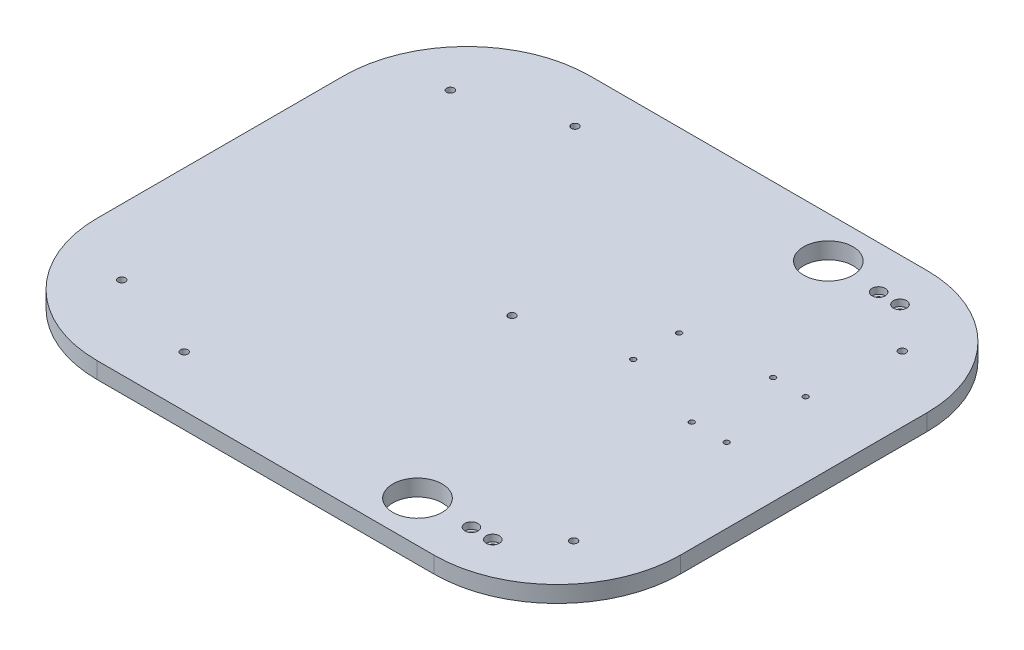
ISO-10303-21;
HEADER;
FILE_DESCRIPTION(('STEP AP214'),'2;1');
FILE_NAME('part.step','',(''),(''),'','','');
FILE_SCHEMA(('AUTOMOTIVE_DESIGN { 1 0 10303 214 1 1 1 1 }'));
ENDSEC;
DATA;
#1=APPLICATION_CONTEXT('core data for automotive mechanical design processes');
#2=APPLICATION_PROTOCOL_DEFINITION('international standard','automotive_design',2000,#1);
#3=PRODUCT_CONTEXT('',#1,'mechanical');
#4=PRODUCT('Part','Part','',(#3));
#5=PRODUCT_RELATED_PRODUCT_CATEGORY('part','',(#4));
#6=PRODUCT_DEFINITION_FORMATION('','',#4);
#7=PRODUCT_DEFINITION_CONTEXT('part definition',#1,'design');
#8=PRODUCT_DEFINITION('design','',#6,#7);
#9=PRODUCT_DEFINITION_SHAPE('','',#8);
#10=(LENGTH_UNIT() NAMED_UNIT(*) SI_UNIT(.MILLI.,.METRE.));
#11=(NAMED_UNIT(*) PLANE_ANGLE_UNIT() SI_UNIT($,.RADIAN.));
#12=(NAMED_UNIT(*) SI_UNIT($,.STERADIAN.) SOLID_ANGLE_UNIT());
#13=UNCERTAINTY_MEASURE_WITH_UNIT(LENGTH_MEASURE(1.E-05),#10,'distance_accuracy_value','');
#14=(GEOMETRIC_REPRESENTATION_CONTEXT(3) GLOBAL_UNCERTAINTY_ASSIGNED_CONTEXT((#13)) GLOBAL_UNIT_ASSIGNED_CONTEXT((#10,
#11,#12)) REPRESENTATION_CONTEXT('',''));
#15=CARTESIAN_POINT('',(0.,0.,0.));
#16=DIRECTION('',(0.,0.,1.));
#17=DIRECTION('',(1.,0.,0.));
#18=AXIS2_PLACEMENT_3D('',#15,#16,#17);
#19=CARTESIAN_POINT('',(0.,10.,0.));
#20=DIRECTION('',(0.,1.,0.));
#21=DIRECTION('',(0.,0.,1.));
#22=AXIS2_PLACEMENT_3D('',#19,#20,#21);
#23=PLANE('',#22);
#24=CARTESIAN_POINT('',(-80.5544997387853,10.,118.9));
#25=DIRECTION('',(0.,1.,0.));
#26=DIRECTION('',(0.,0.,1.));
#27=AXIS2_PLACEMENT_3D('',#24,#25,#26);
#28=CIRCLE('',#27,2.25);
#29=CARTESIAN_POINT('',(-80.5544997387853,10.,121.15));
#30=VERTEX_POINT('',#29);
#31=EDGE_CURVE('E308',#30,#30,#28,.T.);
#32=ORIENTED_EDGE('',*,*,#31,.F.);
#33=EDGE_LOOP('',(#32));
#34=FACE_BOUND('',#33,.T.);
#35=CARTESIAN_POINT('',(-80.5544997387854,10.,-118.9));
#36=DIRECTION('',(0.,1.,0.));
#37=DIRECTION('',(0.,0.,1.));
#38=AXIS2_PLACEMENT_3D('',#35,#36,#37);
#39=CIRCLE('',#38,2.25);
#40=CARTESIAN_POINT('',(-80.5544997387854,10.,-116.65));
#41=VERTEX_POINT('',#40);
#42=EDGE_CURVE('E302',#41,#41,#39,.T.);
#43=ORIENTED_EDGE('',*,*,#42,.F.);
#44=EDGE_LOOP('',(#43));
#45=FACE_BOUND('',#44,.T.);
#46=CARTESIAN_POINT('',(0.,10.,0.));
#47=DIRECTION('',(0.,1.,0.));
#48=DIRECTION('',(0.,0.,1.));
#49=AXIS2_PLACEMENT_3D('',#46,#47,#48);
#50=CIRCLE('',#49,2.25);
#51=CARTESIAN_POINT('',(0.,10.,2.25));
#52=VERTEX_POINT('',#51);
#53=EDGE_CURVE('E296',#52,#52,#50,.T.);
#54=ORIENTED_EDGE('',*,*,#53,.F.);
#55=EDGE_LOOP('',(#54));
#56=FACE_BOUND('',#55,.T.);
#57=CARTESIAN_POINT('',(137.5,10.,100.));
#58=DIRECTION('',(0.,1.,0.));
#59=DIRECTION('',(0.,0.,1.));
#60=AXIS2_PLACEMENT_3D('',#57,#58,#59);
#61=CIRCLE('',#60,2.25);
#62=CARTESIAN_POINT('',(137.5,10.,102.25));
#63=VERTEX_POINT('',#62);
#64=EDGE_CURVE('E290',#63,#63,#61,.T.);
#65=ORIENTED_EDGE('',*,*,#64,.F.);
#66=EDGE_LOOP('',(#65));
#67=FACE_BOUND('',#66,.T.);
#68=CARTESIAN_POINT('',(-137.5,10.,-100.));
#69=DIRECTION('',(0.,1.,0.));
#70=DIRECTION('',(0.,0.,1.));
#71=AXIS2_PLACEMENT_3D('',#68,#69,#70);
#72=CIRCLE('',#71,2.25);
#73=CARTESIAN_POINT('',(-137.5,10.,-97.75));
#74=VERTEX_POINT('',#73);
#75=EDGE_CURVE('E284',#74,#74,#72,.T.);
#76=ORIENTED_EDGE('',*,*,#75,.F.);
#77=EDGE_LOOP('',(#76));
#78=FACE_BOUND('',#77,.T.);
#79=CARTESIAN_POINT('',(-137.5,10.,100.));
#80=DIRECTION('',(0.,1.,0.));
#81=DIRECTION('',(0.,0.,1.));
#82=AXIS2_PLACEMENT_3D('',#79,#80,#81);
#83=CIRCLE('',#82,2.25);
#84=CARTESIAN_POINT('',(-137.5,10.,102.25));
#85=VERTEX_POINT('',#84);
#86=EDGE_CURVE('E278',#85,#85,#83,.T.);
#87=ORIENTED_EDGE('',*,*,#86,.F.);
#88=EDGE_LOOP('',(#87));
#89=FACE_BOUND('',#88,.T.);
#90=CARTESIAN_POINT('',(137.5,10.,-100.));
#91=DIRECTION('',(0.,1.,0.));
#92=DIRECTION('',(0.,0.,1.));
#93=AXIS2_PLACEMENT_3D('',#90,#91,#92);
#94=CIRCLE('',#93,2.25);
#95=CARTESIAN_POINT('',(137.5,10.,-97.75));
#96=VERTEX_POINT('',#95);
#97=EDGE_CURVE('E272',#96,#96,#94,.T.);
#98=ORIENTED_EDGE('',*,*,#97,.F.);
#99=EDGE_LOOP('',(#98));
#100=FACE_BOUND('',#99,.T.);
#101=CARTESIAN_POINT('',(132.110460527628,10.,-46.5350027392989));
#102=DIRECTION('',(0.,1.,0.));
#103=DIRECTION('',(0.,0.,1.));
#104=AXIS2_PLACEMENT_3D('',#101,#102,#103);
#105=CIRCLE('',#104,1.59999999999999);
#106=CARTESIAN_POINT('',(132.110460527628,10.,-44.9350027392989));
#107=VERTEX_POINT('',#106);
#108=EDGE_CURVE('E266',#107,#107,#105,.T.);
#109=ORIENTED_EDGE('',*,*,#108,.F.);
#110=EDGE_LOOP('',(#109));
#111=FACE_BOUND('',#110,.T.);
#112=CARTESIAN_POINT('',(112.111563058018,10.,-46.7450027392988));
#113=DIRECTION('',(0.,1.,0.));
#114=DIRECTION('',(0.,0.,1.));
#115=AXIS2_PLACEMENT_3D('',#112,#113,#114);
#116=CIRCLE('',#115,1.6);
#117=CARTESIAN_POINT('',(112.111563058018,10.,-45.1450027392988));
#118=VERTEX_POINT('',#117);
#119=EDGE_CURVE('E260',#118,#118,#116,.T.);
#120=ORIENTED_EDGE('',*,*,#119,.F.);
#121=EDGE_LOOP('',(#120));
#122=FACE_BOUND('',#121,.T.);
#123=CARTESIAN_POINT('',(110.841563058018,10.,1.51499726070117));
#124=DIRECTION('',(0.,1.,0.));
#125=DIRECTION('',(0.,0.,1.));
#126=AXIS2_PLACEMENT_3D('',#123,#124,#125);
#127=CIRCLE('',#126,1.6);
#128=CARTESIAN_POINT('',(110.841563058018,10.,3.11499726070118));
#129=VERTEX_POINT('',#128);
#130=EDGE_CURVE('E254',#129,#129,#127,.T.);
#131=ORIENTED_EDGE('',*,*,#130,.F.);
#132=EDGE_LOOP('',(#131));
#133=FACE_BOUND('',#132,.T.);
#134=CARTESIAN_POINT('',(132.110460527628,10.,1.51499726070117));
#135=DIRECTION('',(0.,1.,0.));
#136=DIRECTION('',(0.,0.,1.));
#137=AXIS2_PLACEMENT_3D('',#134,#135,#136);
#138=CIRCLE('',#137,1.59999999999999);
#139=CARTESIAN_POINT('',(132.110460527628,10.,3.11499726070116));
#140=VERTEX_POINT('',#139);
#141=EDGE_CURVE('E248',#140,#140,#138,.T.);
#142=ORIENTED_EDGE('',*,*,#141,.F.);
#143=EDGE_LOOP('',(#142));
#144=FACE_BOUND('',#143,.T.);
#145=CARTESIAN_POINT('',(60.0415630580176,10.,-13.7250027392988));
#146=DIRECTION('',(0.,1.,0.));
#147=DIRECTION('',(0.,0.,1.));
#148=AXIS2_PLACEMENT_3D('',#145,#146,#147);
#149=CIRCLE('',#148,1.6);
#150=CARTESIAN_POINT('',(60.0415630580176,10.,-12.1250027392988));
#151=VERTEX_POINT('',#150);
#152=EDGE_CURVE('E242',#151,#151,#149,.T.);
#153=ORIENTED_EDGE('',*,*,#152,.F.);
#154=EDGE_LOOP('',(#153));
#155=FACE_BOUND('',#154,.T.);
#156=CARTESIAN_POINT('',(60.0415630580176,10.,-41.6650027392988));
#157=DIRECTION('',(0.,1.,0.));
#158=DIRECTION('',(0.,0.,1.));
#159=AXIS2_PLACEMENT_3D('',#156,#157,#158);
#160=CIRCLE('',#159,1.6);
#161=CARTESIAN_POINT('',(60.0415630580176,10.,-40.0650027392988));
#162=VERTEX_POINT('',#161);
#163=EDGE_CURVE('E236',#162,#162,#160,.T.);
#164=ORIENTED_EDGE('',*,*,#163,.F.);
#165=EDGE_LOOP('',(#164));
#166=FACE_BOUND('',#165,.T.);
#167=CARTESIAN_POINT('',(99.1999999999999,10.,-123.9));
#168=DIRECTION('',(0.,1.,0.));
#169=DIRECTION('',(0.,0.,1.));
#170=AXIS2_PLACEMENT_3D('',#167,#168,#169);
#171=CIRCLE('',#170,3.99999999999999);
#172=CARTESIAN_POINT('',(99.1999999999999,10.,-119.9));
#173=VERTEX_POINT('',#172);
#174=EDGE_CURVE('E230',#173,#173,#171,.T.);
#175=ORIENTED_EDGE('',*,*,#174,.F.);
#176=EDGE_LOOP('',(#175));
#177=FACE_BOUND('',#176,.T.);
#178=CARTESIAN_POINT('',(112.2,10.,-123.9));
#179=DIRECTION('',(0.,1.,0.));
#180=DIRECTION('',(0.,0.,1.));
#181=AXIS2_PLACEMENT_3D('',#178,#179,#180);
#182=CIRCLE('',#181,3.99999999999999);
#183=CARTESIAN_POINT('',(112.2,10.,-119.9));
#184=VERTEX_POINT('',#183);
#185=EDGE_CURVE('E218',#184,#184,#182,.T.);
#186=ORIENTED_EDGE('',*,*,#185,.F.);
#187=EDGE_LOOP('',(#186));
#188=FACE_BOUND('',#187,.T.);
#189=CARTESIAN_POINT('',(112.2,10.,123.9));
#190=DIRECTION('',(0.,1.,0.));
#191=DIRECTION('',(0.,0.,1.));
#192=AXIS2_PLACEMENT_3D('',#189,#190,#191);
#193=CIRCLE('',#192,3.99999999999999);
#194=CARTESIAN_POINT('',(112.2,10.,127.9));
#195=VERTEX_POINT('',#194);
#196=EDGE_CURVE('E206',#195,#195,#193,.T.);
#197=ORIENTED_EDGE('',*,*,#196,.F.);
#198=EDGE_LOOP('',(#197));
#199=FACE_BOUND('',#198,.T.);
#200=CARTESIAN_POINT('',(99.1999999999999,10.,123.9));
#201=DIRECTION('',(0.,1.,0.));
#202=DIRECTION('',(0.,0.,1.));
#203=AXIS2_PLACEMENT_3D('',#200,#201,#202);
#204=CIRCLE('',#203,3.99999999999999);
#205=CARTESIAN_POINT('',(99.1999999999999,10.,127.9));
#206=VERTEX_POINT('',#205);
#207=EDGE_CURVE('E194',#206,#206,#204,.T.);
#208=ORIENTED_EDGE('',*,*,#207,.F.);
#209=EDGE_LOOP('',(#208));
#210=FACE_BOUND('',#209,.T.);
#211=CARTESIAN_POINT('',(67.5,10.,125.));
#212=DIRECTION('',(0.,1.,0.));
#213=DIRECTION('',(0.,0.,1.));
#214=AXIS2_PLACEMENT_3D('',#211,#212,#213);
#215=CIRCLE('',#214,15.);
#216=CARTESIAN_POINT('',(67.5,10.,140.));
#217=VERTEX_POINT('',#216);
#218=EDGE_CURVE('E166',#217,#217,#215,.T.);
#219=ORIENTED_EDGE('',*,*,#218,.F.);
#220=EDGE_LOOP('',(#219));
#221=FACE_BOUND('',#220,.T.);
#222=DIRECTION('',(1.,0.,0.));
#223=VECTOR('',#222,1.);
#224=CARTESIAN_POINT('',(-177.5,10.,150.));
#225=LINE('',#224,#223);
#226=CARTESIAN_POINT('',(-102.5,10.,150.));
#227=VERTEX_POINT('',#226);
#228=CARTESIAN_POINT('',(102.5,10.,150.));
#229=VERTEX_POINT('',#228);
#230=EDGE_CURVE('E170',#227,#229,#225,.T.);
#231=ORIENTED_EDGE('',*,*,#230,.T.);
#232=CARTESIAN_POINT('',(102.5,10.,75.));
#233=DIRECTION('',(0.,1.,0.));
#234=DIRECTION('',(0.,0.,1.));
#235=AXIS2_PLACEMENT_3D('',#232,#233,#234);
#236=CIRCLE('',#235,75.);
#237=CARTESIAN_POINT('',(177.5,10.,75.));
#238=VERTEX_POINT('',#237);
#239=EDGE_CURVE('E153',#229,#238,#236,.T.);
#240=ORIENTED_EDGE('',*,*,#239,.T.);
#241=DIRECTION('',(0.,0.,-1.));
#242=VECTOR('',#241,1.);
#243=CARTESIAN_POINT('',(177.5,10.,150.));
#244=LINE('',#243,#242);
#245=CARTESIAN_POINT('',(177.5,10.,-75.));
#246=VERTEX_POINT('',#245);
#247=EDGE_CURVE('E124',#238,#246,#244,.T.);
#248=ORIENTED_EDGE('',*,*,#247,.T.);
#249=CARTESIAN_POINT('',(102.5,10.,-75.));
#250=DIRECTION('',(0.,1.,0.));
#251=DIRECTION('',(0.,0.,1.));
#252=AXIS2_PLACEMENT_3D('',#249,#250,#251);
#253=CIRCLE('',#252,75.);
#254=CARTESIAN_POINT('',(102.5,10.,-150.));
#255=VERTEX_POINT('',#254);
#256=EDGE_CURVE('E151',#246,#255,#253,.T.);
#257=ORIENTED_EDGE('',*,*,#256,.T.);
#258=DIRECTION('',(-1.,0.,0.));
#259=VECTOR('',#258,1.);
#260=CARTESIAN_POINT('',(177.5,10.,-150.));
#261=LINE('',#260,#259);
#262=CARTESIAN_POINT('',(-102.5,10.,-150.));
#263=VERTEX_POINT('',#262);
#264=EDGE_CURVE('E131',#255,#263,#261,.T.);
#265=ORIENTED_EDGE('',*,*,#264,.T.);
#266=CARTESIAN_POINT('',(-102.5,10.,-75.));
#267=DIRECTION('',(0.,1.,0.));
#268=DIRECTION('',(0.,0.,1.));
#269=AXIS2_PLACEMENT_3D('',#266,#267,#268);
#270=CIRCLE('',#269,75.);
#271=CARTESIAN_POINT('',(-177.5,10.,-75.));
#272=VERTEX_POINT('',#271);
#273=EDGE_CURVE('E59',#263,#272,#270,.T.);
#274=ORIENTED_EDGE('',*,*,#273,.T.);
#275=DIRECTION('',(0.,0.,1.));
#276=VECTOR('',#275,1.);
#277=CARTESIAN_POINT('',(-177.5,10.,-150.));
#278=LINE('',#277,#276);
#279=CARTESIAN_POINT('',(-177.5,10.,75.));
#280=VERTEX_POINT('',#279);
#281=EDGE_CURVE('E134',#272,#280,#278,.T.);
#282=ORIENTED_EDGE('',*,*,#281,.T.);
#283=CARTESIAN_POINT('',(-102.5,10.,75.));
#284=DIRECTION('',(0.,1.,0.));
#285=DIRECTION('',(0.,0.,1.));
#286=AXIS2_PLACEMENT_3D('',#283,#284,#285);
#287=CIRCLE('',#286,75.);
#288=EDGE_CURVE('E149',#280,#227,#287,.T.);
#289=ORIENTED_EDGE('',*,*,#288,.T.);
#290=EDGE_LOOP('',(#231,#240,#248,#257,#265,#274,#282,#289));
#291=FACE_BOUND('',#290,.T.);
#292=CARTESIAN_POINT('',(67.5,10.,-125.));
#293=DIRECTION('',(0.,1.,0.));
#294=DIRECTION('',(0.,0.,1.));
#295=AXIS2_PLACEMENT_3D('',#292,#293,#294);
#296=CIRCLE('',#295,15.);
#297=CARTESIAN_POINT('',(67.5,10.,-110.));
#298=VERTEX_POINT('',#297);
#299=EDGE_CURVE('E177',#298,#298,#296,.T.);
#300=ORIENTED_EDGE('',*,*,#299,.F.);
#301=EDGE_LOOP('',(#300));
#302=FACE_BOUND('',#301,.T.);
#303=ADVANCED_FACE('F39',(#34,#45,#56,#67,#78,#89,#100,#111,#122,#133,#144,#155,#166,#177,#188,
#199,#210,#221,#291,#302),#23,.T.);
#304=CARTESIAN_POINT('',(0.,0.,0.));
#305=DIRECTION('',(0.,1.,0.));
#306=DIRECTION('',(0.,0.,1.));
#307=AXIS2_PLACEMENT_3D('',#304,#305,#306);
#308=PLANE('',#307);
#309=CARTESIAN_POINT('',(-80.5544997387853,0.,118.9));
#310=DIRECTION('',(0.,1.,0.));
#311=DIRECTION('',(0.,0.,1.));
#312=AXIS2_PLACEMENT_3D('',#309,#310,#311);
#313=CIRCLE('',#312,2.25);
#314=CARTESIAN_POINT('',(-80.5544997387853,0.,121.15));
#315=VERTEX_POINT('',#314);
#316=EDGE_CURVE('E305',#315,#315,#313,.T.);
#317=ORIENTED_EDGE('',*,*,#316,.T.);
#318=EDGE_LOOP('',(#317));
#319=FACE_BOUND('',#318,.T.);
#320=CARTESIAN_POINT('',(-80.5544997387854,0.,-118.9));
#321=DIRECTION('',(0.,1.,0.));
#322=DIRECTION('',(0.,0.,1.));
#323=AXIS2_PLACEMENT_3D('',#320,#321,#322);
#324=CIRCLE('',#323,2.25);
#325=CARTESIAN_POINT('',(-80.5544997387854,0.,-116.65));
#326=VERTEX_POINT('',#325);
#327=EDGE_CURVE('E299',#326,#326,#324,.T.);
#328=ORIENTED_EDGE('',*,*,#327,.T.);
#329=EDGE_LOOP('',(#328));
#330=FACE_BOUND('',#329,.T.);
#331=CARTESIAN_POINT('',(0.,0.,0.));
#332=DIRECTION('',(0.,1.,0.));
#333=DIRECTION('',(0.,0.,1.));
#334=AXIS2_PLACEMENT_3D('',#331,#332,#333);
#335=CIRCLE('',#334,2.25);
#336=CARTESIAN_POINT('',(0.,0.,2.25));
#337=VERTEX_POINT('',#336);
#338=EDGE_CURVE('E293',#337,#337,#335,.T.);
#339=ORIENTED_EDGE('',*,*,#338,.T.);
#340=EDGE_LOOP('',(#339));
#341=FACE_BOUND('',#340,.T.);
#342=CARTESIAN_POINT('',(137.5,0.,100.));
#343=DIRECTION('',(0.,1.,0.));
#344=DIRECTION('',(0.,0.,1.));
#345=AXIS2_PLACEMENT_3D('',#342,#343,#344);
#346=CIRCLE('',#345,2.25);
#347=CARTESIAN_POINT('',(137.5,0.,102.25));
#348=VERTEX_POINT('',#347);
#349=EDGE_CURVE('E287',#348,#348,#346,.T.);
#350=ORIENTED_EDGE('',*,*,#349,.T.);
#351=EDGE_LOOP('',(#350));
#352=FACE_BOUND('',#351,.T.);
#353=CARTESIAN_POINT('',(-137.5,0.,-100.));
#354=DIRECTION('',(0.,1.,0.));
#355=DIRECTION('',(0.,0.,1.));
#356=AXIS2_PLACEMENT_3D('',#353,#354,#355);
#357=CIRCLE('',#356,2.25);
#358=CARTESIAN_POINT('',(-137.5,0.,-97.75));
#359=VERTEX_POINT('',#358);
#360=EDGE_CURVE('E281',#359,#359,#357,.T.);
#361=ORIENTED_EDGE('',*,*,#360,.T.);
#362=EDGE_LOOP('',(#361));
#363=FACE_BOUND('',#362,.T.);
#364=CARTESIAN_POINT('',(-137.5,0.,100.));
#365=DIRECTION('',(0.,1.,0.));
#366=DIRECTION('',(0.,0.,1.));
#367=AXIS2_PLACEMENT_3D('',#364,#365,#366);
#368=CIRCLE('',#367,2.25);
#369=CARTESIAN_POINT('',(-137.5,0.,102.25));
#370=VERTEX_POINT('',#369);
#371=EDGE_CURVE('E275',#370,#370,#368,.T.);
#372=ORIENTED_EDGE('',*,*,#371,.T.);
#373=EDGE_LOOP('',(#372));
#374=FACE_BOUND('',#373,.T.);
#375=CARTESIAN_POINT('',(137.5,0.,-100.));
#376=DIRECTION('',(0.,1.,0.));
#377=DIRECTION('',(0.,0.,1.));
#378=AXIS2_PLACEMENT_3D('',#375,#376,#377);
#379=CIRCLE('',#378,2.25);
#380=CARTESIAN_POINT('',(137.5,0.,-97.75));
#381=VERTEX_POINT('',#380);
#382=EDGE_CURVE('E269',#381,#381,#379,.T.);
#383=ORIENTED_EDGE('',*,*,#382,.T.);
#384=EDGE_LOOP('',(#383));
#385=FACE_BOUND('',#384,.T.);
#386=CARTESIAN_POINT('',(132.110460527628,0.,-46.5350027392989));
#387=DIRECTION('',(0.,1.,0.));
#388=DIRECTION('',(0.,0.,1.));
#389=AXIS2_PLACEMENT_3D('',#386,#387,#388);
#390=CIRCLE('',#389,1.59999999999999);
#391=CARTESIAN_POINT('',(132.110460527628,0.,-44.9350027392989));
#392=VERTEX_POINT('',#391);
#393=EDGE_CURVE('E263',#392,#392,#390,.T.);
#394=ORIENTED_EDGE('',*,*,#393,.T.);
#395=EDGE_LOOP('',(#394));
#396=FACE_BOUND('',#395,.T.);
#397=CARTESIAN_POINT('',(112.111563058018,0.,-46.7450027392988));
#398=DIRECTION('',(0.,1.,0.));
#399=DIRECTION('',(0.,0.,1.));
#400=AXIS2_PLACEMENT_3D('',#397,#398,#399);
#401=CIRCLE('',#400,1.6);
#402=CARTESIAN_POINT('',(112.111563058018,0.,-45.1450027392988));
#403=VERTEX_POINT('',#402);
#404=EDGE_CURVE('E257',#403,#403,#401,.T.);
#405=ORIENTED_EDGE('',*,*,#404,.T.);
#406=EDGE_LOOP('',(#405));
#407=FACE_BOUND('',#406,.T.);
#408=CARTESIAN_POINT('',(110.841563058018,0.,1.51499726070117));
#409=DIRECTION('',(0.,1.,0.));
#410=DIRECTION('',(0.,0.,1.));
#411=AXIS2_PLACEMENT_3D('',#408,#409,#410);
#412=CIRCLE('',#411,1.6);
#413=CARTESIAN_POINT('',(110.841563058018,0.,3.11499726070118));
#414=VERTEX_POINT('',#413);
#415=EDGE_CURVE('E251',#414,#414,#412,.T.);
#416=ORIENTED_EDGE('',*,*,#415,.T.);
#417=EDGE_LOOP('',(#416));
#418=FACE_BOUND('',#417,.T.);
#419=CARTESIAN_POINT('',(132.110460527628,0.,1.51499726070117));
#420=DIRECTION('',(0.,1.,0.));
#421=DIRECTION('',(0.,0.,1.));
#422=AXIS2_PLACEMENT_3D('',#419,#420,#421);
#423=CIRCLE('',#422,1.59999999999999);
#424=CARTESIAN_POINT('',(132.110460527628,0.,3.11499726070116));
#425=VERTEX_POINT('',#424);
#426=EDGE_CURVE('E245',#425,#425,#423,.T.);
#427=ORIENTED_EDGE('',*,*,#426,.T.);
#428=EDGE_LOOP('',(#427));
#429=FACE_BOUND('',#428,.T.);
#430=CARTESIAN_POINT('',(60.0415630580176,0.,-13.7250027392988));
#431=DIRECTION('',(0.,1.,0.));
#432=DIRECTION('',(0.,0.,1.));
#433=AXIS2_PLACEMENT_3D('',#430,#431,#432);
#434=CIRCLE('',#433,1.6);
#435=CARTESIAN_POINT('',(60.0415630580176,0.,-12.1250027392988));
#436=VERTEX_POINT('',#435);
#437=EDGE_CURVE('E239',#436,#436,#434,.T.);
#438=ORIENTED_EDGE('',*,*,#437,.T.);
#439=EDGE_LOOP('',(#438));
#440=FACE_BOUND('',#439,.T.);
#441=CARTESIAN_POINT('',(60.0415630580176,0.,-41.6650027392988));
#442=DIRECTION('',(0.,1.,0.));
#443=DIRECTION('',(0.,0.,1.));
#444=AXIS2_PLACEMENT_3D('',#441,#442,#443);
#445=CIRCLE('',#444,1.6);
#446=CARTESIAN_POINT('',(60.0415630580176,0.,-40.0650027392988));
#447=VERTEX_POINT('',#446);
#448=EDGE_CURVE('E233',#447,#447,#445,.T.);
#449=ORIENTED_EDGE('',*,*,#448,.T.);
#450=EDGE_LOOP('',(#449));
#451=FACE_BOUND('',#450,.T.);
#452=CARTESIAN_POINT('',(99.1999999999999,0.,-123.9));
#453=DIRECTION('',(0.,1.,0.));
#454=DIRECTION('',(0.,0.,1.));
#455=AXIS2_PLACEMENT_3D('',#452,#453,#454);
#456=CIRCLE('',#455,2.25000000000002);
#457=CARTESIAN_POINT('',(99.1999999999999,0.,-121.65));
#458=VERTEX_POINT('',#457);
#459=EDGE_CURVE('E221',#458,#458,#456,.T.);
#460=ORIENTED_EDGE('',*,*,#459,.T.);
#461=EDGE_LOOP('',(#460));
#462=FACE_BOUND('',#461,.T.);
#463=CARTESIAN_POINT('',(112.2,0.,-123.9));
#464=DIRECTION('',(0.,1.,0.));
#465=DIRECTION('',(0.,0.,1.));
#466=AXIS2_PLACEMENT_3D('',#463,#464,#465);
#467=CIRCLE('',#466,2.25000000000002);
#468=CARTESIAN_POINT('',(112.2,0.,-121.65));
#469=VERTEX_POINT('',#468);
#470=EDGE_CURVE('E209',#469,#469,#467,.T.);
#471=ORIENTED_EDGE('',*,*,#470,.T.);
#472=EDGE_LOOP('',(#471));
#473=FACE_BOUND('',#472,.T.);
#474=CARTESIAN_POINT('',(112.2,0.,123.9));
#475=DIRECTION('',(0.,1.,0.));
#476=DIRECTION('',(0.,0.,1.));
#477=AXIS2_PLACEMENT_3D('',#474,#475,#476);
#478=CIRCLE('',#477,2.25000000000002);
#479=CARTESIAN_POINT('',(112.2,0.,126.15));
#480=VERTEX_POINT('',#479);
#481=EDGE_CURVE('E197',#480,#480,#478,.T.);
#482=ORIENTED_EDGE('',*,*,#481,.T.);
#483=EDGE_LOOP('',(#482));
#484=FACE_BOUND('',#483,.T.);
#485=CARTESIAN_POINT('',(99.1999999999999,0.,123.9));
#486=DIRECTION('',(0.,1.,0.));
#487=DIRECTION('',(0.,0.,1.));
#488=AXIS2_PLACEMENT_3D('',#485,#486,#487);
#489=CIRCLE('',#488,2.25000000000002);
#490=CARTESIAN_POINT('',(99.1999999999999,0.,126.15));
#491=VERTEX_POINT('',#490);
#492=EDGE_CURVE('E183',#491,#491,#489,.T.);
#493=ORIENTED_EDGE('',*,*,#492,.T.);
#494=EDGE_LOOP('',(#493));
#495=FACE_BOUND('',#494,.T.);
#496=DIRECTION('',(0.,0.,-1.));
#497=VECTOR('',#496,1.);
#498=CARTESIAN_POINT('',(177.5,0.,150.));
#499=LINE('',#498,#497);
#500=CARTESIAN_POINT('',(177.5,0.,75.));
#501=VERTEX_POINT('',#500);
#502=CARTESIAN_POINT('',(177.5,0.,-75.));
#503=VERTEX_POINT('',#502);
#504=EDGE_CURVE('E121',#501,#503,#499,.T.);
#505=ORIENTED_EDGE('',*,*,#504,.F.);
#506=CARTESIAN_POINT('',(102.5,0.,75.));
#507=DIRECTION('',(0.,1.,0.));
#508=DIRECTION('',(0.,0.,1.));
#509=AXIS2_PLACEMENT_3D('',#506,#507,#508);
#510=CIRCLE('',#509,75.);
#511=CARTESIAN_POINT('',(102.5,0.,150.));
#512=VERTEX_POINT('',#511);
#513=EDGE_CURVE('E104',#501,#512,#510,.F.);
#514=ORIENTED_EDGE('',*,*,#513,.T.);
#515=DIRECTION('',(1.,0.,0.));
#516=VECTOR('',#515,1.);
#517=CARTESIAN_POINT('',(-177.5,0.,150.));
#518=LINE('',#517,#516);
#519=CARTESIAN_POINT('',(-102.5,0.,150.));
#520=VERTEX_POINT('',#519);
#521=EDGE_CURVE('E132',#520,#512,#518,.T.);
#522=ORIENTED_EDGE('',*,*,#521,.F.);
#523=CARTESIAN_POINT('',(-102.5,0.,75.));
#524=DIRECTION('',(0.,1.,0.));
#525=DIRECTION('',(0.,0.,1.));
#526=AXIS2_PLACEMENT_3D('',#523,#524,#525);
#527=CIRCLE('',#526,75.);
#528=CARTESIAN_POINT('',(-177.5,0.,75.));
#529=VERTEX_POINT('',#528);
#530=EDGE_CURVE('E142',#520,#529,#527,.F.);
#531=ORIENTED_EDGE('',*,*,#530,.T.);
#532=DIRECTION('',(0.,0.,1.));
#533=VECTOR('',#532,1.);
#534=CARTESIAN_POINT('',(-177.5,0.,-150.));
#535=LINE('',#534,#533);
#536=CARTESIAN_POINT('',(-177.5,0.,-75.));
#537=VERTEX_POINT('',#536);
#538=EDGE_CURVE('E136',#537,#529,#535,.T.);
#539=ORIENTED_EDGE('',*,*,#538,.F.);
#540=CARTESIAN_POINT('',(-102.5,0.,-75.));
#541=DIRECTION('',(0.,1.,0.));
#542=DIRECTION('',(0.,0.,1.));
#543=AXIS2_PLACEMENT_3D('',#540,#541,#542);
#544=CIRCLE('',#543,75.);
#545=CARTESIAN_POINT('',(-102.5,0.,-150.));
#546=VERTEX_POINT('',#545);
#547=EDGE_CURVE('E125',#537,#546,#544,.F.);
#548=ORIENTED_EDGE('',*,*,#547,.T.);
#549=DIRECTION('',(-1.,0.,0.));
#550=VECTOR('',#549,1.);
#551=CARTESIAN_POINT('',(177.5,0.,-150.));
#552=LINE('',#551,#550);
#553=CARTESIAN_POINT('',(102.5,0.,-150.));
#554=VERTEX_POINT('',#553);
#555=EDGE_CURVE('E165',#554,#546,#552,.T.);
#556=ORIENTED_EDGE('',*,*,#555,.F.);
#557=CARTESIAN_POINT('',(102.5,0.,-75.));
#558=DIRECTION('',(0.,1.,0.));
#559=DIRECTION('',(0.,0.,1.));
#560=AXIS2_PLACEMENT_3D('',#557,#558,#559);
#561=CIRCLE('',#560,75.);
#562=EDGE_CURVE('E115',#554,#503,#561,.F.);
#563=ORIENTED_EDGE('',*,*,#562,.T.);
#564=EDGE_LOOP('',(#505,#514,#522,#531,#539,#548,#556,#563));
#565=FACE_BOUND('',#564,.T.);
#566=CARTESIAN_POINT('',(67.5,0.,125.));
#567=DIRECTION('',(0.,1.,0.));
#568=DIRECTION('',(0.,0.,1.));
#569=AXIS2_PLACEMENT_3D('',#566,#567,#568);
#570=CIRCLE('',#569,15.);
#571=CARTESIAN_POINT('',(67.5,0.,140.));
#572=VERTEX_POINT('',#571);
#573=EDGE_CURVE('E174',#572,#572,#570,.T.);
#574=ORIENTED_EDGE('',*,*,#573,.T.);
#575=EDGE_LOOP('',(#574));
#576=FACE_BOUND('',#575,.T.);
#577=CARTESIAN_POINT('',(67.5,0.,-125.));
#578=DIRECTION('',(0.,1.,0.));
#579=DIRECTION('',(0.,0.,1.));
#580=AXIS2_PLACEMENT_3D('',#577,#578,#579);
#581=CIRCLE('',#580,15.);
#582=CARTESIAN_POINT('',(67.5,0.,-110.));
#583=VERTEX_POINT('',#582);
#584=EDGE_CURVE('E180',#583,#583,#581,.T.);
#585=ORIENTED_EDGE('',*,*,#584,.T.);
#586=EDGE_LOOP('',(#585));
#587=FACE_BOUND('',#586,.T.);
#588=ADVANCED_FACE('F128',(#319,#330,#341,#352,#363,#374,#385,#396,#407,#418,#429,#440,#451,
#462,#473,#484,#495,#565,#576,#587),#308,.F.);
#589=CARTESIAN_POINT('',(177.5,10.,-150.));
#590=DIRECTION('',(0.,0.,1.));
#591=DIRECTION('',(1.,0.,0.));
#592=AXIS2_PLACEMENT_3D('',#589,#590,#591);
#593=PLANE('',#592);
#594=ORIENTED_EDGE('',*,*,#264,.F.);
#595=DIRECTION('',(0.,-1.,0.));
#596=VECTOR('',#595,1.);
#597=CARTESIAN_POINT('',(102.5,10.,-150.));
#598=LINE('',#597,#596);
#599=EDGE_CURVE('E157',#255,#554,#598,.T.);
#600=ORIENTED_EDGE('',*,*,#599,.T.);
#601=ORIENTED_EDGE('',*,*,#555,.T.);
#602=DIRECTION('',(0.,-1.,0.));
#603=VECTOR('',#602,1.);
#604=CARTESIAN_POINT('',(-102.5,10.,-150.));
#605=LINE('',#604,#603);
#606=EDGE_CURVE('E155',#546,#263,#605,.F.);
#607=ORIENTED_EDGE('',*,*,#606,.T.);
#608=EDGE_LOOP('',(#594,#600,#601,#607));
#609=FACE_BOUND('',#608,.T.);
#610=ADVANCED_FACE('F363',(#609),#593,.F.);
#611=CARTESIAN_POINT('',(-177.5,10.,-150.));
#612=DIRECTION('',(1.,0.,0.));
#613=DIRECTION('',(0.,0.,-1.));
#614=AXIS2_PLACEMENT_3D('',#611,#612,#613);
#615=PLANE('',#614);
#616=ORIENTED_EDGE('',*,*,#538,.T.);
#617=DIRECTION('',(0.,-1.,0.));
#618=VECTOR('',#617,1.);
#619=CARTESIAN_POINT('',(-177.5,10.,75.));
#620=LINE('',#619,#618);
#621=EDGE_CURVE('E11',#529,#280,#620,.F.);
#622=ORIENTED_EDGE('',*,*,#621,.T.);
#623=ORIENTED_EDGE('',*,*,#281,.F.);
#624=DIRECTION('',(0.,-1.,0.));
#625=VECTOR('',#624,1.);
#626=CARTESIAN_POINT('',(-177.5,10.,-75.));
#627=LINE('',#626,#625);
#628=EDGE_CURVE('E47',#272,#537,#627,.T.);
#629=ORIENTED_EDGE('',*,*,#628,.T.);
#630=EDGE_LOOP('',(#616,#622,#623,#629));
#631=FACE_BOUND('',#630,.T.);
#632=ADVANCED_FACE('F162',(#631),#615,.F.);
#633=CARTESIAN_POINT('',(-177.5,10.,150.));
#634=DIRECTION('',(0.,0.,-1.));
#635=DIRECTION('',(-1.,0.,0.));
#636=AXIS2_PLACEMENT_3D('',#633,#634,#635);
#637=PLANE('',#636);
#638=ORIENTED_EDGE('',*,*,#521,.T.);
#639=DIRECTION('',(0.,-1.,0.));
#640=VECTOR('',#639,1.);
#641=CARTESIAN_POINT('',(102.5,10.,150.));
#642=LINE('',#641,#640);
#643=EDGE_CURVE('E109',#512,#229,#642,.F.);
#644=ORIENTED_EDGE('',*,*,#643,.T.);
#645=ORIENTED_EDGE('',*,*,#230,.F.);
#646=DIRECTION('',(0.,-1.,0.));
#647=VECTOR('',#646,1.);
#648=CARTESIAN_POINT('',(-102.5,10.,150.));
#649=LINE('',#648,#647);
#650=EDGE_CURVE('E114',#227,#520,#649,.T.);
#651=ORIENTED_EDGE('',*,*,#650,.T.);
#652=EDGE_LOOP('',(#638,#644,#645,#651));
#653=FACE_BOUND('',#652,.T.);
#654=ADVANCED_FACE('F376',(#653),#637,.F.);
#655=CARTESIAN_POINT('',(177.5,10.,150.));
#656=DIRECTION('',(-1.,0.,0.));
#657=DIRECTION('',(0.,0.,1.));
#658=AXIS2_PLACEMENT_3D('',#655,#656,#657);
#659=PLANE('',#658);
#660=ORIENTED_EDGE('',*,*,#247,.F.);
#661=DIRECTION('',(0.,-1.,0.));
#662=VECTOR('',#661,1.);
#663=CARTESIAN_POINT('',(177.5,10.,75.));
#664=LINE('',#663,#662);
#665=EDGE_CURVE('E108',#238,#501,#664,.T.);
#666=ORIENTED_EDGE('',*,*,#665,.T.);
#667=ORIENTED_EDGE('',*,*,#504,.T.);
#668=DIRECTION('',(0.,-1.,0.));
#669=VECTOR('',#668,1.);
#670=CARTESIAN_POINT('',(177.5,10.,-75.));
#671=LINE('',#670,#669);
#672=EDGE_CURVE('E126',#503,#246,#671,.F.);
#673=ORIENTED_EDGE('',*,*,#672,.T.);
#674=EDGE_LOOP('',(#660,#666,#667,#673));
#675=FACE_BOUND('',#674,.T.);
#676=ADVANCED_FACE('F120',(#675),#659,.F.);
#677=CARTESIAN_POINT('',(67.5,10.,125.));
#678=DIRECTION('',(0.,-1.,0.));
#679=DIRECTION('',(0.,0.,-1.));
#680=AXIS2_PLACEMENT_3D('',#677,#678,#679);
#681=CYLINDRICAL_SURFACE('',#680,15.);
#682=ORIENTED_EDGE('',*,*,#218,.T.);
#683=EDGE_LOOP('',(#682));
#684=FACE_BOUND('',#683,.T.);
#685=ORIENTED_EDGE('',*,*,#573,.F.);
#686=EDGE_LOOP('',(#685));
#687=FACE_BOUND('',#686,.T.);
#688=ADVANCED_FACE('F358',(#684,#687),#681,.F.);
#689=CARTESIAN_POINT('',(67.5,10.,-125.));
#690=DIRECTION('',(0.,-1.,0.));
#691=DIRECTION('',(0.,0.,-1.));
#692=AXIS2_PLACEMENT_3D('',#689,#690,#691);
#693=CYLINDRICAL_SURFACE('',#692,15.);
#694=ORIENTED_EDGE('',*,*,#299,.T.);
#695=EDGE_LOOP('',(#694));
#696=FACE_BOUND('',#695,.T.);
#697=ORIENTED_EDGE('',*,*,#584,.F.);
#698=EDGE_LOOP('',(#697));
#699=FACE_BOUND('',#698,.T.);
#700=ADVANCED_FACE('F354',(#696,#699),#693,.F.);
#701=CARTESIAN_POINT('',(99.1999999999999,10.,123.9));
#702=DIRECTION('',(0.,1.,0.));
#703=DIRECTION('',(0.,0.,1.));
#704=AXIS2_PLACEMENT_3D('',#701,#702,#703);
#705=CYLINDRICAL_SURFACE('',#704,2.25000000000001);
#706=ORIENTED_EDGE('',*,*,#492,.F.);
#707=EDGE_LOOP('',(#706));
#708=FACE_BOUND('',#707,.T.);
#709=CARTESIAN_POINT('',(99.1999999999999,6.,123.9));
#710=DIRECTION('',(0.,1.,0.));
#711=DIRECTION('',(0.,0.,1.));
#712=AXIS2_PLACEMENT_3D('',#709,#710,#711);
#713=CIRCLE('',#712,2.25);
#714=CARTESIAN_POINT('',(99.1999999999999,6.,126.15));
#715=VERTEX_POINT('',#714);
#716=EDGE_CURVE('E188',#715,#715,#713,.T.);
#717=ORIENTED_EDGE('',*,*,#716,.T.);
#718=EDGE_LOOP('',(#717));
#719=FACE_BOUND('',#718,.T.);
#720=ADVANCED_FACE('F357',(#708,#719),#705,.F.);
#721=CARTESIAN_POINT('',(101.45,6.,123.9));
#722=DIRECTION('',(0.,-1.,0.));
#723=DIRECTION('',(0.,0.,-1.));
#724=AXIS2_PLACEMENT_3D('',#721,#722,#723);
#725=PLANE('',#724);
#726=ORIENTED_EDGE('',*,*,#716,.F.);
#727=EDGE_LOOP('',(#726));
#728=FACE_BOUND('',#727,.T.);
#729=CARTESIAN_POINT('',(99.1999999999999,6.,123.9));
#730=DIRECTION('',(0.,1.,0.));
#731=DIRECTION('',(0.,0.,1.));
#732=AXIS2_PLACEMENT_3D('',#729,#730,#731);
#733=CIRCLE('',#732,4.);
#734=CARTESIAN_POINT('',(99.1999999999999,6.,127.9));
#735=VERTEX_POINT('',#734);
#736=EDGE_CURVE('E191',#735,#735,#733,.T.);
#737=ORIENTED_EDGE('',*,*,#736,.T.);
#738=EDGE_LOOP('',(#737));
#739=FACE_BOUND('',#738,.T.);
#740=ADVANCED_FACE('F647',(#728,#739),#725,.F.);
#741=CARTESIAN_POINT('',(99.1999999999999,10.,123.9));
#742=DIRECTION('',(0.,1.,0.));
#743=DIRECTION('',(0.,0.,1.));
#744=AXIS2_PLACEMENT_3D('',#741,#742,#743);
#745=CYLINDRICAL_SURFACE('',#744,4.);
#746=ORIENTED_EDGE('',*,*,#736,.F.);
#747=EDGE_LOOP('',(#746));
#748=FACE_BOUND('',#747,.T.);
#749=ORIENTED_EDGE('',*,*,#207,.T.);
#750=EDGE_LOOP('',(#749));
#751=FACE_BOUND('',#750,.T.);
#752=ADVANCED_FACE('F637',(#748,#751),#745,.F.);
#753=CARTESIAN_POINT('',(112.2,10.,123.9));
#754=DIRECTION('',(0.,1.,0.));
#755=DIRECTION('',(0.,0.,1.));
#756=AXIS2_PLACEMENT_3D('',#753,#754,#755);
#757=CYLINDRICAL_SURFACE('',#756,2.25000000000001);
#758=ORIENTED_EDGE('',*,*,#481,.F.);
#759=EDGE_LOOP('',(#758));
#760=FACE_BOUND('',#759,.T.);
#761=CARTESIAN_POINT('',(112.2,6.,123.9));
#762=DIRECTION('',(0.,1.,0.));
#763=DIRECTION('',(0.,0.,1.));
#764=AXIS2_PLACEMENT_3D('',#761,#762,#763);
#765=CIRCLE('',#764,2.25);
#766=CARTESIAN_POINT('',(112.2,6.,126.15));
#767=VERTEX_POINT('',#766);
#768=EDGE_CURVE('E200',#767,#767,#765,.T.);
#769=ORIENTED_EDGE('',*,*,#768,.T.);
#770=EDGE_LOOP('',(#769));
#771=FACE_BOUND('',#770,.T.);
#772=ADVANCED_FACE('F627',(#760,#771),#757,.F.);
#773=CARTESIAN_POINT('',(114.45,6.,123.9));
#774=DIRECTION('',(0.,-1.,0.));
#775=DIRECTION('',(0.,0.,-1.));
#776=AXIS2_PLACEMENT_3D('',#773,#774,#775);
#777=PLANE('',#776);
#778=ORIENTED_EDGE('',*,*,#768,.F.);
#779=EDGE_LOOP('',(#778));
#780=FACE_BOUND('',#779,.T.);
#781=CARTESIAN_POINT('',(112.2,6.,123.9));
#782=DIRECTION('',(0.,1.,0.));
#783=DIRECTION('',(0.,0.,1.));
#784=AXIS2_PLACEMENT_3D('',#781,#782,#783);
#785=CIRCLE('',#784,4.);
#786=CARTESIAN_POINT('',(112.2,6.,127.9));
#787=VERTEX_POINT('',#786);
#788=EDGE_CURVE('E203',#787,#787,#785,.T.);
#789=ORIENTED_EDGE('',*,*,#788,.T.);
#790=EDGE_LOOP('',(#789));
#791=FACE_BOUND('',#790,.T.);
#792=ADVANCED_FACE('F617',(#780,#791),#777,.F.);
#793=CARTESIAN_POINT('',(112.2,10.,123.9));
#794=DIRECTION('',(0.,1.,0.));
#795=DIRECTION('',(0.,0.,1.));
#796=AXIS2_PLACEMENT_3D('',#793,#794,#795);
#797=CYLINDRICAL_SURFACE('',#796,4.);
#798=ORIENTED_EDGE('',*,*,#788,.F.);
#799=EDGE_LOOP('',(#798));
#800=FACE_BOUND('',#799,.T.);
#801=ORIENTED_EDGE('',*,*,#196,.T.);
#802=EDGE_LOOP('',(#801));
#803=FACE_BOUND('',#802,.T.);
#804=ADVANCED_FACE('F607',(#800,#803),#797,.F.);
#805=CARTESIAN_POINT('',(112.2,10.,-123.9));
#806=DIRECTION('',(0.,1.,0.));
#807=DIRECTION('',(0.,0.,1.));
#808=AXIS2_PLACEMENT_3D('',#805,#806,#807);
#809=CYLINDRICAL_SURFACE('',#808,2.25000000000001);
#810=ORIENTED_EDGE('',*,*,#470,.F.);
#811=EDGE_LOOP('',(#810));
#812=FACE_BOUND('',#811,.T.);
#813=CARTESIAN_POINT('',(112.2,6.,-123.9));
#814=DIRECTION('',(0.,1.,0.));
#815=DIRECTION('',(0.,0.,1.));
#816=AXIS2_PLACEMENT_3D('',#813,#814,#815);
#817=CIRCLE('',#816,2.25);
#818=CARTESIAN_POINT('',(112.2,6.,-121.65));
#819=VERTEX_POINT('',#818);
#820=EDGE_CURVE('E212',#819,#819,#817,.T.);
#821=ORIENTED_EDGE('',*,*,#820,.T.);
#822=EDGE_LOOP('',(#821));
#823=FACE_BOUND('',#822,.T.);
#824=ADVANCED_FACE('F597',(#812,#823),#809,.F.);
#825=CARTESIAN_POINT('',(114.45,6.,-123.9));
#826=DIRECTION('',(0.,-1.,0.));
#827=DIRECTION('',(0.,0.,-1.));
#828=AXIS2_PLACEMENT_3D('',#825,#826,#827);
#829=PLANE('',#828);
#830=ORIENTED_EDGE('',*,*,#820,.F.);
#831=EDGE_LOOP('',(#830));
#832=FACE_BOUND('',#831,.T.);
#833=CARTESIAN_POINT('',(112.2,6.,-123.9));
#834=DIRECTION('',(0.,1.,0.));
#835=DIRECTION('',(0.,0.,1.));
#836=AXIS2_PLACEMENT_3D('',#833,#834,#835);
#837=CIRCLE('',#836,4.);
#838=CARTESIAN_POINT('',(112.2,6.,-119.9));
#839=VERTEX_POINT('',#838);
#840=EDGE_CURVE('E215',#839,#839,#837,.T.);
#841=ORIENTED_EDGE('',*,*,#840,.T.);
#842=EDGE_LOOP('',(#841));
#843=FACE_BOUND('',#842,.T.);
#844=ADVANCED_FACE('F587',(#832,#843),#829,.F.);
#845=CARTESIAN_POINT('',(112.2,10.,-123.9));
#846=DIRECTION('',(0.,1.,0.));
#847=DIRECTION('',(0.,0.,1.));
#848=AXIS2_PLACEMENT_3D('',#845,#846,#847);
#849=CYLINDRICAL_SURFACE('',#848,4.);
#850=ORIENTED_EDGE('',*,*,#840,.F.);
#851=EDGE_LOOP('',(#850));
#852=FACE_BOUND('',#851,.T.);
#853=ORIENTED_EDGE('',*,*,#185,.T.);
#854=EDGE_LOOP('',(#853));
#855=FACE_BOUND('',#854,.T.);
#856=ADVANCED_FACE('F577',(#852,#855),#849,.F.);
#857=CARTESIAN_POINT('',(99.1999999999999,10.,-123.9));
#858=DIRECTION('',(0.,1.,0.));
#859=DIRECTION('',(0.,0.,1.));
#860=AXIS2_PLACEMENT_3D('',#857,#858,#859);
#861=CYLINDRICAL_SURFACE('',#860,2.25000000000001);
#862=ORIENTED_EDGE('',*,*,#459,.F.);
#863=EDGE_LOOP('',(#862));
#864=FACE_BOUND('',#863,.T.);
#865=CARTESIAN_POINT('',(99.1999999999999,6.,-123.9));
#866=DIRECTION('',(0.,1.,0.));
#867=DIRECTION('',(0.,0.,1.));
#868=AXIS2_PLACEMENT_3D('',#865,#866,#867);
#869=CIRCLE('',#868,2.25);
#870=CARTESIAN_POINT('',(99.1999999999999,6.,-121.65));
#871=VERTEX_POINT('',#870);
#872=EDGE_CURVE('E224',#871,#871,#869,.T.);
#873=ORIENTED_EDGE('',*,*,#872,.T.);
#874=EDGE_LOOP('',(#873));
#875=FACE_BOUND('',#874,.T.);
#876=ADVANCED_FACE('F567',(#864,#875),#861,.F.);
#877=CARTESIAN_POINT('',(101.45,6.,-123.9));
#878=DIRECTION('',(0.,-1.,0.));
#879=DIRECTION('',(0.,0.,-1.));
#880=AXIS2_PLACEMENT_3D('',#877,#878,#879);
#881=PLANE('',#880);
#882=ORIENTED_EDGE('',*,*,#872,.F.);
#883=EDGE_LOOP('',(#882));
#884=FACE_BOUND('',#883,.T.);
#885=CARTESIAN_POINT('',(99.1999999999999,6.,-123.9));
#886=DIRECTION('',(0.,1.,0.));
#887=DIRECTION('',(0.,0.,1.));
#888=AXIS2_PLACEMENT_3D('',#885,#886,#887);
#889=CIRCLE('',#888,4.);
#890=CARTESIAN_POINT('',(99.1999999999999,6.,-119.9));
#891=VERTEX_POINT('',#890);
#892=EDGE_CURVE('E227',#891,#891,#889,.T.);
#893=ORIENTED_EDGE('',*,*,#892,.T.);
#894=EDGE_LOOP('',(#893));
#895=FACE_BOUND('',#894,.T.);
#896=ADVANCED_FACE('F557',(#884,#895),#881,.F.);
#897=CARTESIAN_POINT('',(99.1999999999999,10.,-123.9));
#898=DIRECTION('',(0.,1.,0.));
#899=DIRECTION('',(0.,0.,1.));
#900=AXIS2_PLACEMENT_3D('',#897,#898,#899);
#901=CYLINDRICAL_SURFACE('',#900,4.);
#902=ORIENTED_EDGE('',*,*,#892,.F.);
#903=EDGE_LOOP('',(#902));
#904=FACE_BOUND('',#903,.T.);
#905=ORIENTED_EDGE('',*,*,#174,.T.);
#906=EDGE_LOOP('',(#905));
#907=FACE_BOUND('',#906,.T.);
#908=ADVANCED_FACE('F547',(#904,#907),#901,.F.);
#909=CARTESIAN_POINT('',(60.0415630580176,10.,-41.6650027392988));
#910=DIRECTION('',(0.,1.,0.));
#911=DIRECTION('',(0.,0.,1.));
#912=AXIS2_PLACEMENT_3D('',#909,#910,#911);
#913=CYLINDRICAL_SURFACE('',#912,1.6);
#914=ORIENTED_EDGE('',*,*,#448,.F.);
#915=EDGE_LOOP('',(#914));
#916=FACE_BOUND('',#915,.T.);
#917=ORIENTED_EDGE('',*,*,#163,.T.);
#918=EDGE_LOOP('',(#917));
#919=FACE_BOUND('',#918,.T.);
#920=ADVANCED_FACE('F537',(#916,#919),#913,.F.);
#921=CARTESIAN_POINT('',(60.0415630580176,10.,-13.7250027392988));
#922=DIRECTION('',(0.,1.,0.));
#923=DIRECTION('',(0.,0.,1.));
#924=AXIS2_PLACEMENT_3D('',#921,#922,#923);
#925=CYLINDRICAL_SURFACE('',#924,1.6);
#926=ORIENTED_EDGE('',*,*,#437,.F.);
#927=EDGE_LOOP('',(#926));
#928=FACE_BOUND('',#927,.T.);
#929=ORIENTED_EDGE('',*,*,#152,.T.);
#930=EDGE_LOOP('',(#929));
#931=FACE_BOUND('',#930,.T.);
#932=ADVANCED_FACE('F527',(#928,#931),#925,.F.);
#933=CARTESIAN_POINT('',(132.110460527628,10.,1.51499726070117));
#934=DIRECTION('',(0.,1.,0.));
#935=DIRECTION('',(0.,0.,1.));
#936=AXIS2_PLACEMENT_3D('',#933,#934,#935);
#937=CYLINDRICAL_SURFACE('',#936,1.59999999999999);
#938=ORIENTED_EDGE('',*,*,#426,.F.);
#939=EDGE_LOOP('',(#938));
#940=FACE_BOUND('',#939,.T.);
#941=ORIENTED_EDGE('',*,*,#141,.T.);
#942=EDGE_LOOP('',(#941));
#943=FACE_BOUND('',#942,.T.);
#944=ADVANCED_FACE('F517',(#940,#943),#937,.F.);
#945=CARTESIAN_POINT('',(110.841563058018,10.,1.51499726070117));
#946=DIRECTION('',(0.,1.,0.));
#947=DIRECTION('',(0.,0.,1.));
#948=AXIS2_PLACEMENT_3D('',#945,#946,#947);
#949=CYLINDRICAL_SURFACE('',#948,1.6);
#950=ORIENTED_EDGE('',*,*,#415,.F.);
#951=EDGE_LOOP('',(#950));
#952=FACE_BOUND('',#951,.T.);
#953=ORIENTED_EDGE('',*,*,#130,.T.);
#954=EDGE_LOOP('',(#953));
#955=FACE_BOUND('',#954,.T.);
#956=ADVANCED_FACE('F507',(#952,#955),#949,.F.);
#957=CARTESIAN_POINT('',(112.111563058018,10.,-46.7450027392988));
#958=DIRECTION('',(0.,1.,0.));
#959=DIRECTION('',(0.,0.,1.));
#960=AXIS2_PLACEMENT_3D('',#957,#958,#959);
#961=CYLINDRICAL_SURFACE('',#960,1.6);
#962=ORIENTED_EDGE('',*,*,#404,.F.);
#963=EDGE_LOOP('',(#962));
#964=FACE_BOUND('',#963,.T.);
#965=ORIENTED_EDGE('',*,*,#119,.T.);
#966=EDGE_LOOP('',(#965));
#967=FACE_BOUND('',#966,.T.);
#968=ADVANCED_FACE('F497',(#964,#967),#961,.F.);
#969=CARTESIAN_POINT('',(132.110460527628,10.,-46.5350027392989));
#970=DIRECTION('',(0.,1.,0.));
#971=DIRECTION('',(0.,0.,1.));
#972=AXIS2_PLACEMENT_3D('',#969,#970,#971);
#973=CYLINDRICAL_SURFACE('',#972,1.59999999999999);
#974=ORIENTED_EDGE('',*,*,#393,.F.);
#975=EDGE_LOOP('',(#974));
#976=FACE_BOUND('',#975,.T.);
#977=ORIENTED_EDGE('',*,*,#108,.T.);
#978=EDGE_LOOP('',(#977));
#979=FACE_BOUND('',#978,.T.);
#980=ADVANCED_FACE('F487',(#976,#979),#973,.F.);
#981=CARTESIAN_POINT('',(137.5,10.,-100.));
#982=DIRECTION('',(0.,1.,0.));
#983=DIRECTION('',(0.,0.,1.));
#984=AXIS2_PLACEMENT_3D('',#981,#982,#983);
#985=CYLINDRICAL_SURFACE('',#984,2.25);
#986=ORIENTED_EDGE('',*,*,#382,.F.);
#987=EDGE_LOOP('',(#986));
#988=FACE_BOUND('',#987,.T.);
#989=ORIENTED_EDGE('',*,*,#97,.T.);
#990=EDGE_LOOP('',(#989));
#991=FACE_BOUND('',#990,.T.);
#992=ADVANCED_FACE('F477',(#988,#991),#985,.F.);
#993=CARTESIAN_POINT('',(-137.5,10.,100.));
#994=DIRECTION('',(0.,1.,0.));
#995=DIRECTION('',(0.,0.,1.));
#996=AXIS2_PLACEMENT_3D('',#993,#994,#995);
#997=CYLINDRICAL_SURFACE('',#996,2.25);
#998=ORIENTED_EDGE('',*,*,#371,.F.);
#999=EDGE_LOOP('',(#998));
#1000=FACE_BOUND('',#999,.T.);
#1001=ORIENTED_EDGE('',*,*,#86,.T.);
#1002=EDGE_LOOP('',(#1001));
#1003=FACE_BOUND('',#1002,.T.);
#1004=ADVANCED_FACE('F467',(#1000,#1003),#997,.F.);
#1005=CARTESIAN_POINT('',(-137.5,10.,-100.));
#1006=DIRECTION('',(0.,1.,0.));
#1007=DIRECTION('',(0.,0.,1.));
#1008=AXIS2_PLACEMENT_3D('',#1005,#1006,#1007);
#1009=CYLINDRICAL_SURFACE('',#1008,2.25);
#1010=ORIENTED_EDGE('',*,*,#360,.F.);
#1011=EDGE_LOOP('',(#1010));
#1012=FACE_BOUND('',#1011,.T.);
#1013=ORIENTED_EDGE('',*,*,#75,.T.);
#1014=EDGE_LOOP('',(#1013));
#1015=FACE_BOUND('',#1014,.T.);
#1016=ADVANCED_FACE('F457',(#1012,#1015),#1009,.F.);
#1017=CARTESIAN_POINT('',(137.5,10.,100.));
#1018=DIRECTION('',(0.,1.,0.));
#1019=DIRECTION('',(0.,0.,1.));
#1020=AXIS2_PLACEMENT_3D('',#1017,#1018,#1019);
#1021=CYLINDRICAL_SURFACE('',#1020,2.25);
#1022=ORIENTED_EDGE('',*,*,#349,.F.);
#1023=EDGE_LOOP('',(#1022));
#1024=FACE_BOUND('',#1023,.T.);
#1025=ORIENTED_EDGE('',*,*,#64,.T.);
#1026=EDGE_LOOP('',(#1025));
#1027=FACE_BOUND('',#1026,.T.);
#1028=ADVANCED_FACE('F447',(#1024,#1027),#1021,.F.);
#1029=CARTESIAN_POINT('',(0.,10.,0.));
#1030=DIRECTION('',(0.,1.,0.));
#1031=DIRECTION('',(0.,0.,1.));
#1032=AXIS2_PLACEMENT_3D('',#1029,#1030,#1031);
#1033=CYLINDRICAL_SURFACE('',#1032,2.25);
#1034=ORIENTED_EDGE('',*,*,#338,.F.);
#1035=EDGE_LOOP('',(#1034));
#1036=FACE_BOUND('',#1035,.T.);
#1037=ORIENTED_EDGE('',*,*,#53,.T.);
#1038=EDGE_LOOP('',(#1037));
#1039=FACE_BOUND('',#1038,.T.);
#1040=ADVANCED_FACE('F437',(#1036,#1039),#1033,.F.);
#1041=CARTESIAN_POINT('',(-80.5544997387854,10.,-118.9));
#1042=DIRECTION('',(0.,1.,0.));
#1043=DIRECTION('',(0.,0.,1.));
#1044=AXIS2_PLACEMENT_3D('',#1041,#1042,#1043);
#1045=CYLINDRICAL_SURFACE('',#1044,2.25);
#1046=ORIENTED_EDGE('',*,*,#327,.F.);
#1047=EDGE_LOOP('',(#1046));
#1048=FACE_BOUND('',#1047,.T.);
#1049=ORIENTED_EDGE('',*,*,#42,.T.);
#1050=EDGE_LOOP('',(#1049));
#1051=FACE_BOUND('',#1050,.T.);
#1052=ADVANCED_FACE('F427',(#1048,#1051),#1045,.F.);
#1053=CARTESIAN_POINT('',(-80.5544997387853,10.,118.9));
#1054=DIRECTION('',(0.,1.,0.));
#1055=DIRECTION('',(0.,0.,1.));
#1056=AXIS2_PLACEMENT_3D('',#1053,#1054,#1055);
#1057=CYLINDRICAL_SURFACE('',#1056,2.25);
#1058=ORIENTED_EDGE('',*,*,#316,.F.);
#1059=EDGE_LOOP('',(#1058));
#1060=FACE_BOUND('',#1059,.T.);
#1061=ORIENTED_EDGE('',*,*,#31,.T.);
#1062=EDGE_LOOP('',(#1061));
#1063=FACE_BOUND('',#1062,.T.);
#1064=ADVANCED_FACE('F312',(#1060,#1063),#1057,.F.);
#1065=CARTESIAN_POINT('',(102.5,10.,75.));
#1066=DIRECTION('',(0.,-1.,0.));
#1067=DIRECTION('',(0.,0.,-1.));
#1068=AXIS2_PLACEMENT_3D('',#1065,#1066,#1067);
#1069=CYLINDRICAL_SURFACE('',#1068,75.);
#1070=ORIENTED_EDGE('',*,*,#239,.F.);
#1071=ORIENTED_EDGE('',*,*,#643,.F.);
#1072=ORIENTED_EDGE('',*,*,#513,.F.);
#1073=ORIENTED_EDGE('',*,*,#665,.F.);
#1074=EDGE_LOOP('',(#1070,#1071,#1072,#1073));
#1075=FACE_BOUND('',#1074,.T.);
#1076=ADVANCED_FACE('F107',(#1075),#1069,.T.);
#1077=CARTESIAN_POINT('',(102.5,10.,-75.));
#1078=DIRECTION('',(0.,-1.,0.));
#1079=DIRECTION('',(0.,0.,-1.));
#1080=AXIS2_PLACEMENT_3D('',#1077,#1078,#1079);
#1081=CYLINDRICAL_SURFACE('',#1080,75.);
#1082=ORIENTED_EDGE('',*,*,#256,.F.);
#1083=ORIENTED_EDGE('',*,*,#672,.F.);
#1084=ORIENTED_EDGE('',*,*,#562,.F.);
#1085=ORIENTED_EDGE('',*,*,#599,.F.);
#1086=EDGE_LOOP('',(#1082,#1083,#1084,#1085));
#1087=FACE_BOUND('',#1086,.T.);
#1088=ADVANCED_FACE('F384',(#1087),#1081,.T.);
#1089=CARTESIAN_POINT('',(-102.5,10.,75.));
#1090=DIRECTION('',(0.,-1.,0.));
#1091=DIRECTION('',(0.,0.,-1.));
#1092=AXIS2_PLACEMENT_3D('',#1089,#1090,#1091);
#1093=CYLINDRICAL_SURFACE('',#1092,75.);
#1094=ORIENTED_EDGE('',*,*,#288,.F.);
#1095=ORIENTED_EDGE('',*,*,#621,.F.);
#1096=ORIENTED_EDGE('',*,*,#530,.F.);
#1097=ORIENTED_EDGE('',*,*,#650,.F.);
#1098=EDGE_LOOP('',(#1094,#1095,#1096,#1097));
#1099=FACE_BOUND('',#1098,.T.);
#1100=ADVANCED_FACE('F386',(#1099),#1093,.T.);
#1101=CARTESIAN_POINT('',(-102.5,10.,-75.));
#1102=DIRECTION('',(0.,-1.,0.));
#1103=DIRECTION('',(0.,0.,-1.));
#1104=AXIS2_PLACEMENT_3D('',#1101,#1102,#1103);
#1105=CYLINDRICAL_SURFACE('',#1104,75.);
#1106=ORIENTED_EDGE('',*,*,#273,.F.);
#1107=ORIENTED_EDGE('',*,*,#606,.F.);
#1108=ORIENTED_EDGE('',*,*,#547,.F.);
#1109=ORIENTED_EDGE('',*,*,#628,.F.);
#1110=EDGE_LOOP('',(#1106,#1107,#1108,#1109));
#1111=FACE_BOUND('',#1110,.T.);
#1112=ADVANCED_FACE('F41',(#1111),#1105,.T.);
#1113=CLOSED_SHELL('',(#303,#588,#610,#632,#654,#676,#688,#700,#720,#740,#752,#772,#792,#804,
#824,#844,#856,#876,#896,#908,#920,#932,#944,#956,#968,#980,#992,#1004,#1016,#1028,#1040,#1052,
#1064,#1076,#1088,#1100,#1112));
#1114=MANIFOLD_SOLID_BREP('B2',#1113);
#1115=ADVANCED_BREP_SHAPE_REPRESENTATION('',(#18,#1114),#14);
#1116=SHAPE_DEFINITION_REPRESENTATION(#9,#1115);
ENDSEC;
END-ISO-10303-21;
